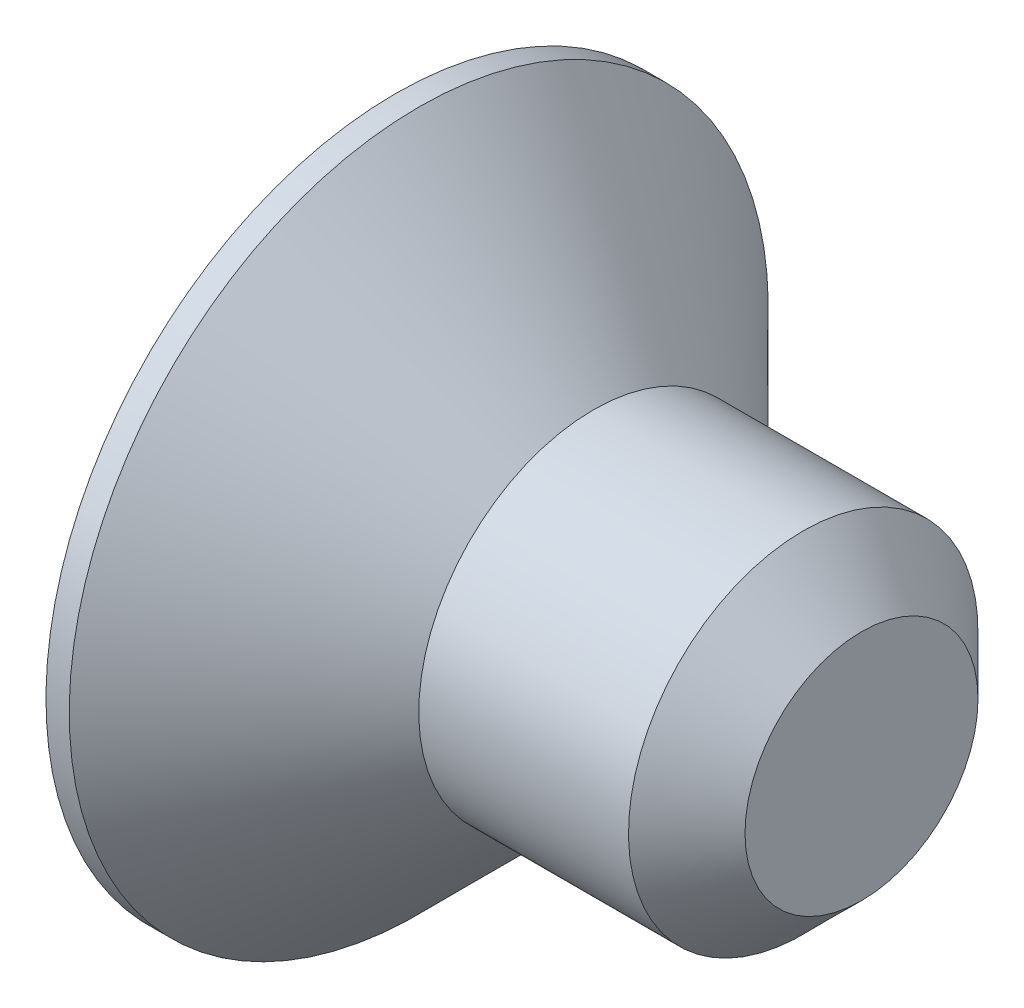
ISO-10303-21;
HEADER;
FILE_DESCRIPTION(('STEP AP214'),'2;1');
FILE_NAME('part.step','',(''),(''),'','','');
FILE_SCHEMA(('AUTOMOTIVE_DESIGN { 1 0 10303 214 1 1 1 1 }'));
ENDSEC;
DATA;
#1=APPLICATION_CONTEXT('core data for automotive mechanical design processes');
#2=APPLICATION_PROTOCOL_DEFINITION('international standard','automotive_design',2000,#1);
#3=PRODUCT_CONTEXT('',#1,'mechanical');
#4=PRODUCT('Part','Part','',(#3));
#5=PRODUCT_RELATED_PRODUCT_CATEGORY('part','',(#4));
#6=PRODUCT_DEFINITION_FORMATION('','',#4);
#7=PRODUCT_DEFINITION_CONTEXT('part definition',#1,'design');
#8=PRODUCT_DEFINITION('design','',#6,#7);
#9=PRODUCT_DEFINITION_SHAPE('','',#8);
#10=(LENGTH_UNIT() NAMED_UNIT(*) SI_UNIT(.MILLI.,.METRE.));
#11=(NAMED_UNIT(*) PLANE_ANGLE_UNIT() SI_UNIT($,.RADIAN.));
#12=(NAMED_UNIT(*) SI_UNIT($,.STERADIAN.) SOLID_ANGLE_UNIT());
#13=UNCERTAINTY_MEASURE_WITH_UNIT(LENGTH_MEASURE(1.E-05),#10,'distance_accuracy_value','');
#14=(GEOMETRIC_REPRESENTATION_CONTEXT(3) GLOBAL_UNCERTAINTY_ASSIGNED_CONTEXT((#13)) GLOBAL_UNIT_ASSIGNED_CONTEXT((#10,
#11,#12)) REPRESENTATION_CONTEXT('',''));
#15=CARTESIAN_POINT('',(0.,0.,0.));
#16=DIRECTION('',(0.,0.,1.));
#17=DIRECTION('',(1.,0.,0.));
#18=AXIS2_PLACEMENT_3D('',#15,#16,#17);
#19=CARTESIAN_POINT('',(0.,0.,0.));
#20=DIRECTION('',(-1.,0.,0.));
#21=DIRECTION('',(0.,-1.,0.));
#22=AXIS2_PLACEMENT_3D('',#19,#20,#21);
#23=PLANE('',#22);
#24=DIRECTION('',(0.,0.5,-0.866025403784438));
#25=VECTOR('',#24,1.);
#26=CARTESIAN_POINT('',(0.,0.577350269189626,1.));
#27=LINE('',#26,#25);
#28=CARTESIAN_POINT('',(0.,0.577350269189626,1.));
#29=VERTEX_POINT('',#28);
#30=CARTESIAN_POINT('',(0.,1.15470053837925,0.));
#31=VERTEX_POINT('',#30);
#32=EDGE_CURVE('E48',#29,#31,#27,.T.);
#33=ORIENTED_EDGE('',*,*,#32,.F.);
#34=DIRECTION('',(0.,1.,0.));
#35=VECTOR('',#34,1.);
#36=CARTESIAN_POINT('',(0.,-0.577350269189626,1.));
#37=LINE('',#36,#35);
#38=CARTESIAN_POINT('',(0.,-0.577350269189626,1.));
#39=VERTEX_POINT('',#38);
#40=EDGE_CURVE('E131',#39,#29,#37,.T.);
#41=ORIENTED_EDGE('',*,*,#40,.F.);
#42=DIRECTION('',(0.,0.5,0.866025403784439));
#43=VECTOR('',#42,1.);
#44=CARTESIAN_POINT('',(0.,-1.15470053837925,0.));
#45=LINE('',#44,#43);
#46=CARTESIAN_POINT('',(0.,-1.15470053837925,0.));
#47=VERTEX_POINT('',#46);
#48=EDGE_CURVE('E129',#47,#39,#45,.T.);
#49=ORIENTED_EDGE('',*,*,#48,.F.);
#50=DIRECTION('',(0.,-0.5,0.866025403784439));
#51=VECTOR('',#50,1.);
#52=CARTESIAN_POINT('',(0.,-0.577350269189625,-1.));
#53=LINE('',#52,#51);
#54=CARTESIAN_POINT('',(0.,-0.577350269189625,-1.));
#55=VERTEX_POINT('',#54);
#56=EDGE_CURVE('E96',#55,#47,#53,.T.);
#57=ORIENTED_EDGE('',*,*,#56,.F.);
#58=DIRECTION('',(0.,-1.,0.));
#59=VECTOR('',#58,1.);
#60=CARTESIAN_POINT('',(0.,0.577350269189626,-1.));
#61=LINE('',#60,#59);
#62=CARTESIAN_POINT('',(0.,0.577350269189626,-1.));
#63=VERTEX_POINT('',#62);
#64=EDGE_CURVE('E125',#63,#55,#61,.T.);
#65=ORIENTED_EDGE('',*,*,#64,.F.);
#66=DIRECTION('',(0.,-0.5,-0.866025403784439));
#67=VECTOR('',#66,1.);
#68=CARTESIAN_POINT('',(0.,1.15470053837925,0.));
#69=LINE('',#68,#67);
#70=EDGE_CURVE('E122',#31,#63,#69,.T.);
#71=ORIENTED_EDGE('',*,*,#70,.F.);
#72=EDGE_LOOP('',(#33,#41,#49,#57,#65,#71));
#73=FACE_BOUND('',#72,.T.);
#74=CARTESIAN_POINT('',(0.,0.,0.));
#75=DIRECTION('',(1.,0.,0.));
#76=DIRECTION('',(0.,1.,0.));
#77=AXIS2_PLACEMENT_3D('',#74,#75,#76);
#78=CIRCLE('',#77,3.);
#79=CARTESIAN_POINT('',(0.,3.,0.));
#80=VERTEX_POINT('',#79);
#81=EDGE_CURVE('E146',#80,#80,#78,.T.);
#82=ORIENTED_EDGE('',*,*,#81,.F.);
#83=EDGE_LOOP('',(#82));
#84=FACE_BOUND('',#83,.T.);
#85=ADVANCED_FACE('F33',(#73,#84),#23,.T.);
#86=CARTESIAN_POINT('',(4.,0.,0.));
#87=DIRECTION('',(1.,0.,0.));
#88=DIRECTION('',(0.,1.,0.));
#89=AXIS2_PLACEMENT_3D('',#86,#87,#88);
#90=CYLINDRICAL_SURFACE('',#89,3.);
#91=ORIENTED_EDGE('',*,*,#81,.T.);
#92=EDGE_LOOP('',(#91));
#93=FACE_BOUND('',#92,.T.);
#94=CARTESIAN_POINT('',(0.199999999999965,0.,0.));
#95=DIRECTION('',(1.,0.,0.));
#96=DIRECTION('',(0.,1.,0.));
#97=AXIS2_PLACEMENT_3D('',#94,#95,#96);
#98=CIRCLE('',#97,3.);
#99=CARTESIAN_POINT('',(0.199999999999964,3.,0.));
#100=VERTEX_POINT('',#99);
#101=EDGE_CURVE('E143',#100,#100,#98,.T.);
#102=ORIENTED_EDGE('',*,*,#101,.F.);
#103=EDGE_LOOP('',(#102));
#104=FACE_BOUND('',#103,.T.);
#105=ADVANCED_FACE('F166',(#93,#104),#90,.T.);
#106=CARTESIAN_POINT('',(1.7,0.,0.));
#107=DIRECTION('',(-1.,0.,0.));
#108=DIRECTION('',(0.,-1.,0.));
#109=AXIS2_PLACEMENT_3D('',#106,#107,#108);
#110=CONICAL_SURFACE('',#109,1.5,0.785398163397437);
#111=ORIENTED_EDGE('',*,*,#101,.T.);
#112=EDGE_LOOP('',(#111));
#113=FACE_BOUND('',#112,.T.);
#114=CARTESIAN_POINT('',(1.7,0.,0.));
#115=DIRECTION('',(1.,0.,0.));
#116=DIRECTION('',(0.,1.,0.));
#117=AXIS2_PLACEMENT_3D('',#114,#115,#116);
#118=CIRCLE('',#117,1.5);
#119=CARTESIAN_POINT('',(1.7,1.5,0.));
#120=VERTEX_POINT('',#119);
#121=EDGE_CURVE('E135',#120,#120,#118,.T.);
#122=ORIENTED_EDGE('',*,*,#121,.F.);
#123=EDGE_LOOP('',(#122));
#124=FACE_BOUND('',#123,.T.);
#125=ADVANCED_FACE('F171',(#113,#124),#110,.T.);
#126=CARTESIAN_POINT('',(4.,0.,0.));
#127=DIRECTION('',(1.,0.,0.));
#128=DIRECTION('',(0.,1.,0.));
#129=AXIS2_PLACEMENT_3D('',#126,#127,#128);
#130=CYLINDRICAL_SURFACE('',#129,1.5);
#131=CARTESIAN_POINT('',(3.5,0.,0.));
#132=DIRECTION('',(1.,0.,0.));
#133=DIRECTION('',(0.,1.,0.));
#134=AXIS2_PLACEMENT_3D('',#131,#132,#133);
#135=CIRCLE('',#134,1.5);
#136=CARTESIAN_POINT('',(3.5,1.5,0.));
#137=VERTEX_POINT('',#136);
#138=EDGE_CURVE('E11',#137,#137,#135,.F.);
#139=ORIENTED_EDGE('',*,*,#138,.T.);
#140=EDGE_LOOP('',(#139));
#141=FACE_BOUND('',#140,.T.);
#142=ORIENTED_EDGE('',*,*,#121,.T.);
#143=EDGE_LOOP('',(#142));
#144=FACE_BOUND('',#143,.T.);
#145=ADVANCED_FACE('F162',(#141,#144),#130,.T.);
#146=CARTESIAN_POINT('',(4.,1.5,0.));
#147=DIRECTION('',(1.,0.,0.));
#148=DIRECTION('',(0.,1.,0.));
#149=AXIS2_PLACEMENT_3D('',#146,#147,#148);
#150=PLANE('',#149);
#151=CARTESIAN_POINT('',(4.,0.,0.));
#152=DIRECTION('',(1.,0.,0.));
#153=DIRECTION('',(0.,1.,0.));
#154=AXIS2_PLACEMENT_3D('',#151,#152,#153);
#155=CIRCLE('',#154,0.999999999999997);
#156=CARTESIAN_POINT('',(4.,0.999999999999997,0.));
#157=VERTEX_POINT('',#156);
#158=EDGE_CURVE('E41',#157,#157,#155,.T.);
#159=ORIENTED_EDGE('',*,*,#158,.T.);
#160=EDGE_LOOP('',(#159));
#161=FACE_BOUND('',#160,.T.);
#162=ADVANCED_FACE('F151',(#161),#150,.T.);
#163=CARTESIAN_POINT('',(4.,0.,0.));
#164=DIRECTION('',(-1.,0.,0.));
#165=DIRECTION('',(0.,-1.,0.));
#166=AXIS2_PLACEMENT_3D('',#163,#164,#165);
#167=CONICAL_SURFACE('',#166,0.999999999999997,0.785398163397447);
#168=ORIENTED_EDGE('',*,*,#138,.F.);
#169=EDGE_LOOP('',(#168));
#170=FACE_BOUND('',#169,.T.);
#171=ORIENTED_EDGE('',*,*,#158,.F.);
#172=EDGE_LOOP('',(#171));
#173=FACE_BOUND('',#172,.T.);
#174=ADVANCED_FACE('F35',(#170,#173),#167,.T.);
#175=CARTESIAN_POINT('',(1.2,0.577350269189626,1.));
#176=DIRECTION('',(0.,0.866025403784439,0.5));
#177=DIRECTION('',(0.,-0.5,0.866025403784439));
#178=AXIS2_PLACEMENT_3D('',#175,#176,#177);
#179=PLANE('',#178);
#180=ORIENTED_EDGE('',*,*,#32,.T.);
#181=DIRECTION('',(-1.,0.,0.));
#182=VECTOR('',#181,1.);
#183=CARTESIAN_POINT('',(1.2,1.15470053837925,0.));
#184=LINE('',#183,#182);
#185=CARTESIAN_POINT('',(1.2,1.15470053837925,0.));
#186=VERTEX_POINT('',#185);
#187=EDGE_CURVE('E78',#186,#31,#184,.T.);
#188=ORIENTED_EDGE('',*,*,#187,.F.);
#189=DIRECTION('',(0.,0.5,-0.866025403784438));
#190=VECTOR('',#189,1.);
#191=CARTESIAN_POINT('',(1.2,0.577350269189626,1.));
#192=LINE('',#191,#190);
#193=CARTESIAN_POINT('',(1.2,0.577350269189626,1.));
#194=VERTEX_POINT('',#193);
#195=EDGE_CURVE('E133',#194,#186,#192,.T.);
#196=ORIENTED_EDGE('',*,*,#195,.F.);
#197=DIRECTION('',(-1.,0.,0.));
#198=VECTOR('',#197,1.);
#199=CARTESIAN_POINT('',(1.2,0.577350269189626,1.));
#200=LINE('',#199,#198);
#201=EDGE_CURVE('E56',#194,#29,#200,.T.);
#202=ORIENTED_EDGE('',*,*,#201,.T.);
#203=EDGE_LOOP('',(#180,#188,#196,#202));
#204=FACE_BOUND('',#203,.T.);
#205=ADVANCED_FACE('F154',(#204),#179,.F.);
#206=CARTESIAN_POINT('',(1.2,-0.577350269189627,1.));
#207=DIRECTION('',(0.,0.,1.));
#208=DIRECTION('',(0.,-1.,0.));
#209=AXIS2_PLACEMENT_3D('',#206,#207,#208);
#210=PLANE('',#209);
#211=ORIENTED_EDGE('',*,*,#40,.T.);
#212=ORIENTED_EDGE('',*,*,#201,.F.);
#213=DIRECTION('',(0.,1.,0.));
#214=VECTOR('',#213,1.);
#215=CARTESIAN_POINT('',(1.2,-0.577350269189627,1.));
#216=LINE('',#215,#214);
#217=CARTESIAN_POINT('',(1.2,-0.577350269189627,1.));
#218=VERTEX_POINT('',#217);
#219=EDGE_CURVE('E108',#218,#194,#216,.T.);
#220=ORIENTED_EDGE('',*,*,#219,.F.);
#221=DIRECTION('',(-1.,0.,0.));
#222=VECTOR('',#221,1.);
#223=CARTESIAN_POINT('',(1.2,-0.577350269189627,1.));
#224=LINE('',#223,#222);
#225=EDGE_CURVE('E100',#218,#39,#224,.T.);
#226=ORIENTED_EDGE('',*,*,#225,.T.);
#227=EDGE_LOOP('',(#211,#212,#220,#226));
#228=FACE_BOUND('',#227,.T.);
#229=ADVANCED_FACE('F160',(#228),#210,.F.);
#230=CARTESIAN_POINT('',(1.2,-1.15470053837925,0.));
#231=DIRECTION('',(0.,-0.866025403784439,0.5));
#232=DIRECTION('',(0.,-0.5,-0.866025403784439));
#233=AXIS2_PLACEMENT_3D('',#230,#231,#232);
#234=PLANE('',#233);
#235=ORIENTED_EDGE('',*,*,#48,.T.);
#236=ORIENTED_EDGE('',*,*,#225,.F.);
#237=DIRECTION('',(0.,0.5,0.866025403784439));
#238=VECTOR('',#237,1.);
#239=CARTESIAN_POINT('',(1.2,-1.15470053837925,0.));
#240=LINE('',#239,#238);
#241=CARTESIAN_POINT('',(1.2,-1.15470053837925,0.));
#242=VERTEX_POINT('',#241);
#243=EDGE_CURVE('E104',#242,#218,#240,.T.);
#244=ORIENTED_EDGE('',*,*,#243,.F.);
#245=DIRECTION('',(-1.,0.,0.));
#246=VECTOR('',#245,1.);
#247=CARTESIAN_POINT('',(1.2,-1.15470053837925,0.));
#248=LINE('',#247,#246);
#249=EDGE_CURVE('E89',#242,#47,#248,.T.);
#250=ORIENTED_EDGE('',*,*,#249,.T.);
#251=EDGE_LOOP('',(#235,#236,#244,#250));
#252=FACE_BOUND('',#251,.T.);
#253=ADVANCED_FACE('F105',(#252),#234,.F.);
#254=CARTESIAN_POINT('',(1.2,-0.577350269189626,-1.));
#255=DIRECTION('',(0.,-0.866025403784439,-0.5));
#256=DIRECTION('',(0.,0.5,-0.866025403784439));
#257=AXIS2_PLACEMENT_3D('',#254,#255,#256);
#258=PLANE('',#257);
#259=ORIENTED_EDGE('',*,*,#56,.T.);
#260=ORIENTED_EDGE('',*,*,#249,.F.);
#261=DIRECTION('',(0.,-0.5,0.866025403784439));
#262=VECTOR('',#261,1.);
#263=CARTESIAN_POINT('',(1.2,-0.577350269189626,-1.));
#264=LINE('',#263,#262);
#265=CARTESIAN_POINT('',(1.2,-0.577350269189626,-1.));
#266=VERTEX_POINT('',#265);
#267=EDGE_CURVE('E93',#266,#242,#264,.T.);
#268=ORIENTED_EDGE('',*,*,#267,.F.);
#269=DIRECTION('',(-1.,0.,0.));
#270=VECTOR('',#269,1.);
#271=CARTESIAN_POINT('',(1.2,-0.577350269189626,-1.));
#272=LINE('',#271,#270);
#273=EDGE_CURVE('E101',#266,#55,#272,.T.);
#274=ORIENTED_EDGE('',*,*,#273,.T.);
#275=EDGE_LOOP('',(#259,#260,#268,#274));
#276=FACE_BOUND('',#275,.T.);
#277=ADVANCED_FACE('F91',(#276),#258,.F.);
#278=CARTESIAN_POINT('',(1.2,0.577350269189626,-1.));
#279=DIRECTION('',(0.,0.,-1.));
#280=DIRECTION('',(-1.,0.,0.));
#281=AXIS2_PLACEMENT_3D('',#278,#279,#280);
#282=PLANE('',#281);
#283=ORIENTED_EDGE('',*,*,#64,.T.);
#284=ORIENTED_EDGE('',*,*,#273,.F.);
#285=DIRECTION('',(0.,-1.,0.));
#286=VECTOR('',#285,1.);
#287=CARTESIAN_POINT('',(1.2,0.577350269189626,-1.));
#288=LINE('',#287,#286);
#289=CARTESIAN_POINT('',(1.2,0.577350269189626,-1.));
#290=VERTEX_POINT('',#289);
#291=EDGE_CURVE('E114',#290,#266,#288,.T.);
#292=ORIENTED_EDGE('',*,*,#291,.F.);
#293=DIRECTION('',(-1.,0.,0.));
#294=VECTOR('',#293,1.);
#295=CARTESIAN_POINT('',(1.2,0.577350269189626,-1.));
#296=LINE('',#295,#294);
#297=EDGE_CURVE('E138',#290,#63,#296,.T.);
#298=ORIENTED_EDGE('',*,*,#297,.T.);
#299=EDGE_LOOP('',(#283,#284,#292,#298));
#300=FACE_BOUND('',#299,.T.);
#301=ADVANCED_FACE('F185',(#300),#282,.F.);
#302=CARTESIAN_POINT('',(1.2,1.15470053837925,0.));
#303=DIRECTION('',(0.,0.866025403784439,-0.5));
#304=DIRECTION('',(0.,0.5,0.866025403784439));
#305=AXIS2_PLACEMENT_3D('',#302,#303,#304);
#306=PLANE('',#305);
#307=ORIENTED_EDGE('',*,*,#70,.T.);
#308=ORIENTED_EDGE('',*,*,#297,.F.);
#309=DIRECTION('',(0.,-0.5,-0.866025403784439));
#310=VECTOR('',#309,1.);
#311=CARTESIAN_POINT('',(1.2,1.15470053837925,0.));
#312=LINE('',#311,#310);
#313=EDGE_CURVE('E116',#186,#290,#312,.T.);
#314=ORIENTED_EDGE('',*,*,#313,.F.);
#315=ORIENTED_EDGE('',*,*,#187,.T.);
#316=EDGE_LOOP('',(#307,#308,#314,#315));
#317=FACE_BOUND('',#316,.T.);
#318=ADVANCED_FACE('F182',(#317),#306,.F.);
#319=CARTESIAN_POINT('',(1.2,0.,0.));
#320=DIRECTION('',(-1.,0.,0.));
#321=DIRECTION('',(0.,-1.,0.));
#322=AXIS2_PLACEMENT_3D('',#319,#320,#321);
#323=PLANE('',#322);
#324=ORIENTED_EDGE('',*,*,#195,.T.);
#325=ORIENTED_EDGE('',*,*,#313,.T.);
#326=ORIENTED_EDGE('',*,*,#291,.T.);
#327=ORIENTED_EDGE('',*,*,#267,.T.);
#328=ORIENTED_EDGE('',*,*,#243,.T.);
#329=ORIENTED_EDGE('',*,*,#219,.T.);
#330=EDGE_LOOP('',(#324,#325,#326,#327,#328,#329));
#331=FACE_BOUND('',#330,.T.);
#332=ADVANCED_FACE('F111',(#331),#323,.T.);
#333=CLOSED_SHELL('',(#85,#105,#125,#145,#162,#174,#205,#229,#253,#277,#301,#318,#332));
#334=MANIFOLD_SOLID_BREP('B2',#333);
#335=ADVANCED_BREP_SHAPE_REPRESENTATION('',(#18,#334),#14);
#336=SHAPE_DEFINITION_REPRESENTATION(#9,#335);
ENDSEC;
END-ISO-10303-21;
